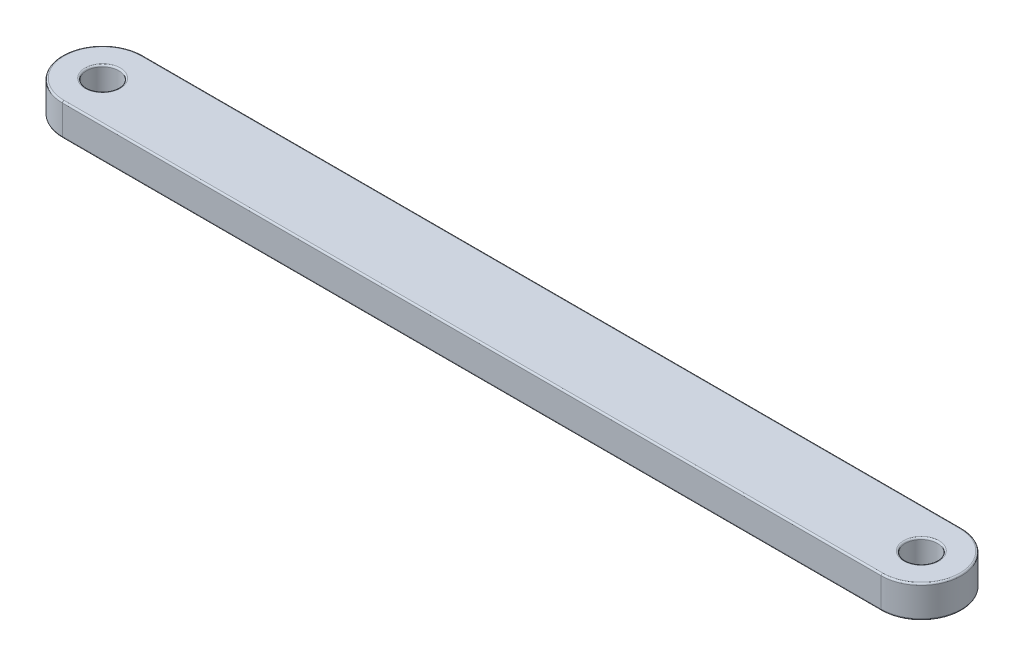
ISO-10303-21;
HEADER;
FILE_DESCRIPTION(('STEP AP214'),'2;1');
FILE_NAME('part.step','',(''),(''),'','','');
FILE_SCHEMA(('AUTOMOTIVE_DESIGN { 1 0 10303 214 1 1 1 1 }'));
ENDSEC;
DATA;
#1=APPLICATION_CONTEXT('core data for automotive mechanical design processes');
#2=APPLICATION_PROTOCOL_DEFINITION('international standard','automotive_design',2000,#1);
#3=PRODUCT_CONTEXT('',#1,'mechanical');
#4=PRODUCT('Part','Part','',(#3));
#5=PRODUCT_RELATED_PRODUCT_CATEGORY('part','',(#4));
#6=PRODUCT_DEFINITION_FORMATION('','',#4);
#7=PRODUCT_DEFINITION_CONTEXT('part definition',#1,'design');
#8=PRODUCT_DEFINITION('design','',#6,#7);
#9=PRODUCT_DEFINITION_SHAPE('','',#8);
#10=(LENGTH_UNIT() NAMED_UNIT(*) SI_UNIT(.MILLI.,.METRE.));
#11=(NAMED_UNIT(*) PLANE_ANGLE_UNIT() SI_UNIT($,.RADIAN.));
#12=(NAMED_UNIT(*) SI_UNIT($,.STERADIAN.) SOLID_ANGLE_UNIT());
#13=UNCERTAINTY_MEASURE_WITH_UNIT(LENGTH_MEASURE(1.E-05),#10,'distance_accuracy_value','');
#14=(GEOMETRIC_REPRESENTATION_CONTEXT(3) GLOBAL_UNCERTAINTY_ASSIGNED_CONTEXT((#13)) GLOBAL_UNIT_ASSIGNED_CONTEXT((#10,
#11,#12)) REPRESENTATION_CONTEXT('',''));
#15=CARTESIAN_POINT('',(0.,0.,0.));
#16=DIRECTION('',(0.,0.,1.));
#17=DIRECTION('',(1.,0.,0.));
#18=AXIS2_PLACEMENT_3D('',#15,#16,#17);
#19=CARTESIAN_POINT('',(-255.,20.,0.));
#20=DIRECTION('',(0.,1.,0.));
#21=DIRECTION('',(0.,0.,1.));
#22=AXIS2_PLACEMENT_3D('',#19,#20,#21);
#23=PLANE('',#22);
#24=CARTESIAN_POINT('',(255.,20.,0.));
#25=DIRECTION('',(0.,1.,0.));
#26=DIRECTION('',(0.,0.,1.));
#27=AXIS2_PLACEMENT_3D('',#24,#25,#26);
#28=CIRCLE('',#27,11.);
#29=CARTESIAN_POINT('',(255.,20.,11.));
#30=VERTEX_POINT('',#29);
#31=EDGE_CURVE('E11',#30,#30,#28,.F.);
#32=ORIENTED_EDGE('',*,*,#31,.T.);
#33=EDGE_LOOP('',(#32));
#34=FACE_BOUND('',#33,.T.);
#35=CARTESIAN_POINT('',(255.,20.,0.));
#36=DIRECTION('',(0.,1.,0.));
#37=DIRECTION('',(0.,0.,1.));
#38=AXIS2_PLACEMENT_3D('',#35,#36,#37);
#39=CIRCLE('',#38,24.);
#40=CARTESIAN_POINT('',(255.,20.,23.9999999999999));
#41=VERTEX_POINT('',#40);
#42=CARTESIAN_POINT('',(255.,20.,-24.0000000000001));
#43=VERTEX_POINT('',#42);
#44=EDGE_CURVE('E49',#41,#43,#39,.T.);
#45=ORIENTED_EDGE('',*,*,#44,.T.);
#46=DIRECTION('',(-1.,0.,0.));
#47=VECTOR('',#46,1.);
#48=CARTESIAN_POINT('',(-255.,20.,-24.));
#49=LINE('',#48,#47);
#50=CARTESIAN_POINT('',(-255.,20.,-24.));
#51=VERTEX_POINT('',#50);
#52=EDGE_CURVE('E41',#43,#51,#49,.T.);
#53=ORIENTED_EDGE('',*,*,#52,.T.);
#54=CARTESIAN_POINT('',(-255.,20.,0.));
#55=DIRECTION('',(0.,1.,0.));
#56=DIRECTION('',(0.,0.,1.));
#57=AXIS2_PLACEMENT_3D('',#54,#55,#56);
#58=CIRCLE('',#57,24.);
#59=CARTESIAN_POINT('',(-255.,20.,24.));
#60=VERTEX_POINT('',#59);
#61=EDGE_CURVE('E167',#51,#60,#58,.T.);
#62=ORIENTED_EDGE('',*,*,#61,.T.);
#63=DIRECTION('',(1.,0.,0.));
#64=VECTOR('',#63,1.);
#65=CARTESIAN_POINT('',(255.,20.,23.9999999999999));
#66=LINE('',#65,#64);
#67=EDGE_CURVE('E54',#60,#41,#66,.T.);
#68=ORIENTED_EDGE('',*,*,#67,.T.);
#69=EDGE_LOOP('',(#45,#53,#62,#68));
#70=FACE_BOUND('',#69,.T.);
#71=CARTESIAN_POINT('',(-255.,20.,0.));
#72=DIRECTION('',(0.,1.,0.));
#73=DIRECTION('',(0.,0.,1.));
#74=AXIS2_PLACEMENT_3D('',#71,#72,#73);
#75=CIRCLE('',#74,11.);
#76=CARTESIAN_POINT('',(-255.,20.,11.));
#77=VERTEX_POINT('',#76);
#78=EDGE_CURVE('E164',#77,#77,#75,.F.);
#79=ORIENTED_EDGE('',*,*,#78,.T.);
#80=EDGE_LOOP('',(#79));
#81=FACE_BOUND('',#80,.T.);
#82=ADVANCED_FACE('F32',(#34,#70,#81),#23,.T.);
#83=CARTESIAN_POINT('',(-255.,0.,0.));
#84=DIRECTION('',(0.,1.,0.));
#85=DIRECTION('',(0.,0.,1.));
#86=AXIS2_PLACEMENT_3D('',#83,#84,#85);
#87=PLANE('',#86);
#88=CARTESIAN_POINT('',(255.,0.,0.));
#89=DIRECTION('',(0.,1.,0.));
#90=DIRECTION('',(0.,0.,1.));
#91=AXIS2_PLACEMENT_3D('',#88,#89,#90);
#92=CIRCLE('',#91,11.);
#93=CARTESIAN_POINT('',(255.,0.,11.));
#94=VERTEX_POINT('',#93);
#95=EDGE_CURVE('E129',#94,#94,#92,.T.);
#96=ORIENTED_EDGE('',*,*,#95,.T.);
#97=EDGE_LOOP('',(#96));
#98=FACE_BOUND('',#97,.T.);
#99=CARTESIAN_POINT('',(-255.,0.,0.));
#100=DIRECTION('',(0.,1.,0.));
#101=DIRECTION('',(0.,0.,1.));
#102=AXIS2_PLACEMENT_3D('',#99,#100,#101);
#103=CIRCLE('',#102,11.);
#104=CARTESIAN_POINT('',(-255.,0.,11.));
#105=VERTEX_POINT('',#104);
#106=EDGE_CURVE('E126',#105,#105,#103,.T.);
#107=ORIENTED_EDGE('',*,*,#106,.T.);
#108=EDGE_LOOP('',(#107));
#109=FACE_BOUND('',#108,.T.);
#110=CARTESIAN_POINT('',(255.,0.,0.));
#111=DIRECTION('',(0.,1.,0.));
#112=DIRECTION('',(0.,0.,1.));
#113=AXIS2_PLACEMENT_3D('',#110,#111,#112);
#114=CIRCLE('',#113,24.);
#115=CARTESIAN_POINT('',(255.,0.,-24.0000000000001));
#116=VERTEX_POINT('',#115);
#117=CARTESIAN_POINT('',(255.,0.,23.9999999999999));
#118=VERTEX_POINT('',#117);
#119=EDGE_CURVE('E125',#116,#118,#114,.F.);
#120=ORIENTED_EDGE('',*,*,#119,.T.);
#121=DIRECTION('',(1.,0.,0.));
#122=VECTOR('',#121,1.);
#123=CARTESIAN_POINT('',(-255.,0.,24.));
#124=LINE('',#123,#122);
#125=CARTESIAN_POINT('',(-255.,0.,24.));
#126=VERTEX_POINT('',#125);
#127=EDGE_CURVE('E104',#118,#126,#124,.F.);
#128=ORIENTED_EDGE('',*,*,#127,.T.);
#129=CARTESIAN_POINT('',(-255.,0.,0.));
#130=DIRECTION('',(0.,1.,0.));
#131=DIRECTION('',(0.,0.,1.));
#132=AXIS2_PLACEMENT_3D('',#129,#130,#131);
#133=CIRCLE('',#132,24.);
#134=CARTESIAN_POINT('',(-255.,0.,-24.));
#135=VERTEX_POINT('',#134);
#136=EDGE_CURVE('E114',#126,#135,#133,.F.);
#137=ORIENTED_EDGE('',*,*,#136,.T.);
#138=DIRECTION('',(-1.,0.,0.));
#139=VECTOR('',#138,1.);
#140=CARTESIAN_POINT('',(-255.,0.,-24.));
#141=LINE('',#140,#139);
#142=EDGE_CURVE('E120',#135,#116,#141,.F.);
#143=ORIENTED_EDGE('',*,*,#142,.T.);
#144=EDGE_LOOP('',(#120,#128,#137,#143));
#145=FACE_BOUND('',#144,.T.);
#146=ADVANCED_FACE('F123',(#98,#109,#145),#87,.F.);
#147=CARTESIAN_POINT('',(-255.,20.,0.));
#148=DIRECTION('',(0.,-1.,0.));
#149=DIRECTION('',(0.,0.,-1.));
#150=AXIS2_PLACEMENT_3D('',#147,#148,#149);
#151=CYLINDRICAL_SURFACE('',#150,25.);
#152=DIRECTION('',(0.,-1.,0.));
#153=VECTOR('',#152,1.);
#154=CARTESIAN_POINT('',(-255.,20.,-25.));
#155=LINE('',#154,#153);
#156=CARTESIAN_POINT('',(-255.,19.,-25.));
#157=VERTEX_POINT('',#156);
#158=CARTESIAN_POINT('',(-255.,1.,-25.));
#159=VERTEX_POINT('',#158);
#160=EDGE_CURVE('E176',#157,#159,#155,.T.);
#161=ORIENTED_EDGE('',*,*,#160,.T.);
#162=CARTESIAN_POINT('',(-255.,1.,0.));
#163=DIRECTION('',(0.,1.,0.));
#164=DIRECTION('',(0.,0.,1.));
#165=AXIS2_PLACEMENT_3D('',#162,#163,#164);
#166=CIRCLE('',#165,25.);
#167=CARTESIAN_POINT('',(-255.,1.,25.));
#168=VERTEX_POINT('',#167);
#169=EDGE_CURVE('E162',#159,#168,#166,.T.);
#170=ORIENTED_EDGE('',*,*,#169,.T.);
#171=DIRECTION('',(0.,-1.,0.));
#172=VECTOR('',#171,1.);
#173=CARTESIAN_POINT('',(-255.,20.,25.));
#174=LINE('',#173,#172);
#175=CARTESIAN_POINT('',(-255.,19.,25.));
#176=VERTEX_POINT('',#175);
#177=EDGE_CURVE('E121',#176,#168,#174,.T.);
#178=ORIENTED_EDGE('',*,*,#177,.F.);
#179=CARTESIAN_POINT('',(-255.,19.,0.));
#180=DIRECTION('',(0.,1.,0.));
#181=DIRECTION('',(0.,0.,1.));
#182=AXIS2_PLACEMENT_3D('',#179,#180,#181);
#183=CIRCLE('',#182,25.);
#184=EDGE_CURVE('E160',#176,#157,#183,.F.);
#185=ORIENTED_EDGE('',*,*,#184,.T.);
#186=EDGE_LOOP('',(#161,#170,#178,#185));
#187=FACE_BOUND('',#186,.T.);
#188=ADVANCED_FACE('F202',(#187),#151,.T.);
#189=CARTESIAN_POINT('',(-255.,20.,25.));
#190=DIRECTION('',(0.,0.,-1.));
#191=DIRECTION('',(-1.,0.,0.));
#192=AXIS2_PLACEMENT_3D('',#189,#190,#191);
#193=PLANE('',#192);
#194=ORIENTED_EDGE('',*,*,#177,.T.);
#195=DIRECTION('',(1.,0.,0.));
#196=VECTOR('',#195,1.);
#197=CARTESIAN_POINT('',(-255.,1.,25.));
#198=LINE('',#197,#196);
#199=CARTESIAN_POINT('',(255.,1.,24.9999999999999));
#200=VERTEX_POINT('',#199);
#201=EDGE_CURVE('E107',#168,#200,#198,.T.);
#202=ORIENTED_EDGE('',*,*,#201,.T.);
#203=DIRECTION('',(0.,-1.,0.));
#204=VECTOR('',#203,1.);
#205=CARTESIAN_POINT('',(255.,20.,24.9999999999999));
#206=LINE('',#205,#204);
#207=CARTESIAN_POINT('',(255.,19.,24.9999999999999));
#208=VERTEX_POINT('',#207);
#209=EDGE_CURVE('E199',#208,#200,#206,.T.);
#210=ORIENTED_EDGE('',*,*,#209,.F.);
#211=DIRECTION('',(1.,0.,0.));
#212=VECTOR('',#211,1.);
#213=CARTESIAN_POINT('',(-255.,19.,25.));
#214=LINE('',#213,#212);
#215=EDGE_CURVE('E148',#208,#176,#214,.F.);
#216=ORIENTED_EDGE('',*,*,#215,.T.);
#217=EDGE_LOOP('',(#194,#202,#210,#216));
#218=FACE_BOUND('',#217,.T.);
#219=ADVANCED_FACE('F197',(#218),#193,.F.);
#220=CARTESIAN_POINT('',(255.,20.,0.));
#221=DIRECTION('',(0.,-1.,0.));
#222=DIRECTION('',(0.,0.,-1.));
#223=AXIS2_PLACEMENT_3D('',#220,#221,#222);
#224=CYLINDRICAL_SURFACE('',#223,25.);
#225=ORIENTED_EDGE('',*,*,#209,.T.);
#226=CARTESIAN_POINT('',(255.,1.,0.));
#227=DIRECTION('',(0.,1.,0.));
#228=DIRECTION('',(0.,0.,1.));
#229=AXIS2_PLACEMENT_3D('',#226,#227,#228);
#230=CIRCLE('',#229,25.);
#231=CARTESIAN_POINT('',(255.,1.,-25.0000000000001));
#232=VERTEX_POINT('',#231);
#233=EDGE_CURVE('E153',#200,#232,#230,.T.);
#234=ORIENTED_EDGE('',*,*,#233,.T.);
#235=DIRECTION('',(0.,-1.,0.));
#236=VECTOR('',#235,1.);
#237=CARTESIAN_POINT('',(255.,20.,-25.0000000000001));
#238=LINE('',#237,#236);
#239=CARTESIAN_POINT('',(255.,19.,-25.0000000000001));
#240=VERTEX_POINT('',#239);
#241=EDGE_CURVE('E205',#240,#232,#238,.T.);
#242=ORIENTED_EDGE('',*,*,#241,.F.);
#243=CARTESIAN_POINT('',(255.,19.,0.));
#244=DIRECTION('',(0.,1.,0.));
#245=DIRECTION('',(0.,0.,1.));
#246=AXIS2_PLACEMENT_3D('',#243,#244,#245);
#247=CIRCLE('',#246,25.);
#248=EDGE_CURVE('E151',#240,#208,#247,.F.);
#249=ORIENTED_EDGE('',*,*,#248,.T.);
#250=EDGE_LOOP('',(#225,#234,#242,#249));
#251=FACE_BOUND('',#250,.T.);
#252=ADVANCED_FACE('F218',(#251),#224,.T.);
#253=CARTESIAN_POINT('',(-255.,20.,-25.));
#254=DIRECTION('',(0.,0.,1.));
#255=DIRECTION('',(1.,0.,0.));
#256=AXIS2_PLACEMENT_3D('',#253,#254,#255);
#257=PLANE('',#256);
#258=ORIENTED_EDGE('',*,*,#241,.T.);
#259=DIRECTION('',(-1.,0.,0.));
#260=VECTOR('',#259,1.);
#261=CARTESIAN_POINT('',(-255.,1.,-25.));
#262=LINE('',#261,#260);
#263=EDGE_CURVE('E158',#232,#159,#262,.T.);
#264=ORIENTED_EDGE('',*,*,#263,.T.);
#265=ORIENTED_EDGE('',*,*,#160,.F.);
#266=DIRECTION('',(-1.,0.,0.));
#267=VECTOR('',#266,1.);
#268=CARTESIAN_POINT('',(255.,19.,-25.0000000000001));
#269=LINE('',#268,#267);
#270=EDGE_CURVE('E155',#157,#240,#269,.F.);
#271=ORIENTED_EDGE('',*,*,#270,.T.);
#272=EDGE_LOOP('',(#258,#264,#265,#271));
#273=FACE_BOUND('',#272,.T.);
#274=ADVANCED_FACE('F222',(#273),#257,.F.);
#275=CARTESIAN_POINT('',(-255.,20.,0.));
#276=DIRECTION('',(0.,-1.,0.));
#277=DIRECTION('',(0.,0.,-1.));
#278=AXIS2_PLACEMENT_3D('',#275,#276,#277);
#279=CYLINDRICAL_SURFACE('',#278,10.);
#280=CARTESIAN_POINT('',(-255.,1.,0.));
#281=DIRECTION('',(0.,1.,0.));
#282=DIRECTION('',(0.,0.,1.));
#283=AXIS2_PLACEMENT_3D('',#280,#281,#282);
#284=CIRCLE('',#283,10.);
#285=CARTESIAN_POINT('',(-255.,1.,10.));
#286=VERTEX_POINT('',#285);
#287=EDGE_CURVE('E145',#286,#286,#284,.F.);
#288=ORIENTED_EDGE('',*,*,#287,.T.);
#289=EDGE_LOOP('',(#288));
#290=FACE_BOUND('',#289,.T.);
#291=CARTESIAN_POINT('',(-255.,19.,0.));
#292=DIRECTION('',(0.,1.,0.));
#293=DIRECTION('',(0.,0.,1.));
#294=AXIS2_PLACEMENT_3D('',#291,#292,#293);
#295=CIRCLE('',#294,10.);
#296=CARTESIAN_POINT('',(-255.,19.,10.));
#297=VERTEX_POINT('',#296);
#298=EDGE_CURVE('E142',#297,#297,#295,.T.);
#299=ORIENTED_EDGE('',*,*,#298,.T.);
#300=EDGE_LOOP('',(#299));
#301=FACE_BOUND('',#300,.T.);
#302=ADVANCED_FACE('F238',(#290,#301),#279,.F.);
#303=CARTESIAN_POINT('',(255.,20.,0.));
#304=DIRECTION('',(0.,-1.,0.));
#305=DIRECTION('',(0.,0.,-1.));
#306=AXIS2_PLACEMENT_3D('',#303,#304,#305);
#307=CYLINDRICAL_SURFACE('',#306,9.99999999999998);
#308=CARTESIAN_POINT('',(255.,1.,0.));
#309=DIRECTION('',(0.,1.,0.));
#310=DIRECTION('',(0.,0.,1.));
#311=AXIS2_PLACEMENT_3D('',#308,#309,#310);
#312=CIRCLE('',#311,9.99999999999998);
#313=CARTESIAN_POINT('',(255.,1.,9.99999999999998));
#314=VERTEX_POINT('',#313);
#315=EDGE_CURVE('E139',#314,#314,#312,.F.);
#316=ORIENTED_EDGE('',*,*,#315,.T.);
#317=EDGE_LOOP('',(#316));
#318=FACE_BOUND('',#317,.T.);
#319=CARTESIAN_POINT('',(255.,19.,0.));
#320=DIRECTION('',(0.,1.,0.));
#321=DIRECTION('',(0.,0.,1.));
#322=AXIS2_PLACEMENT_3D('',#319,#320,#321);
#323=CIRCLE('',#322,9.99999999999998);
#324=CARTESIAN_POINT('',(255.,19.,9.99999999999998));
#325=VERTEX_POINT('',#324);
#326=EDGE_CURVE('E136',#325,#325,#323,.T.);
#327=ORIENTED_EDGE('',*,*,#326,.T.);
#328=EDGE_LOOP('',(#327));
#329=FACE_BOUND('',#328,.T.);
#330=ADVANCED_FACE('F240',(#318,#329),#307,.F.);
#331=CARTESIAN_POINT('',(255.,1.,0.));
#332=DIRECTION('',(0.,1.,0.));
#333=DIRECTION('',(0.,0.,1.));
#334=AXIS2_PLACEMENT_3D('',#331,#332,#333);
#335=TOROIDAL_SURFACE('',#334,11.,1.);
#336=ORIENTED_EDGE('',*,*,#315,.F.);
#337=EDGE_LOOP('',(#336));
#338=FACE_BOUND('',#337,.T.);
#339=ORIENTED_EDGE('',*,*,#95,.F.);
#340=EDGE_LOOP('',(#339));
#341=FACE_BOUND('',#340,.T.);
#342=ADVANCED_FACE('F247',(#338,#341),#335,.T.);
#343=CARTESIAN_POINT('',(-255.,1.,0.));
#344=DIRECTION('',(0.,1.,0.));
#345=DIRECTION('',(0.,0.,1.));
#346=AXIS2_PLACEMENT_3D('',#343,#344,#345);
#347=TOROIDAL_SURFACE('',#346,11.,1.);
#348=ORIENTED_EDGE('',*,*,#287,.F.);
#349=EDGE_LOOP('',(#348));
#350=FACE_BOUND('',#349,.T.);
#351=ORIENTED_EDGE('',*,*,#106,.F.);
#352=EDGE_LOOP('',(#351));
#353=FACE_BOUND('',#352,.T.);
#354=ADVANCED_FACE('F263',(#350,#353),#347,.T.);
#355=CARTESIAN_POINT('',(-255.,1.,-24.));
#356=DIRECTION('',(-1.,0.,0.));
#357=DIRECTION('',(0.,0.,1.));
#358=AXIS2_PLACEMENT_3D('',#355,#356,#357);
#359=CYLINDRICAL_SURFACE('',#358,1.);
#360=CARTESIAN_POINT('',(255.,1.,-24.0000000000001));
#361=DIRECTION('',(1.,0.,0.));
#362=DIRECTION('',(0.,0.,-1.));
#363=AXIS2_PLACEMENT_3D('',#360,#361,#362);
#364=CIRCLE('',#363,1.);
#365=EDGE_CURVE('E110',#116,#232,#364,.T.);
#366=ORIENTED_EDGE('',*,*,#365,.F.);
#367=ORIENTED_EDGE('',*,*,#142,.F.);
#368=CARTESIAN_POINT('',(-255.,1.,-24.));
#369=DIRECTION('',(-1.,0.,0.));
#370=DIRECTION('',(0.,0.,1.));
#371=AXIS2_PLACEMENT_3D('',#368,#369,#370);
#372=CIRCLE('',#371,1.);
#373=EDGE_CURVE('E117',#159,#135,#372,.T.);
#374=ORIENTED_EDGE('',*,*,#373,.F.);
#375=ORIENTED_EDGE('',*,*,#263,.F.);
#376=EDGE_LOOP('',(#366,#367,#374,#375));
#377=FACE_BOUND('',#376,.T.);
#378=ADVANCED_FACE('F211',(#377),#359,.T.);
#379=CARTESIAN_POINT('',(-255.,1.,0.));
#380=DIRECTION('',(0.,1.,0.));
#381=DIRECTION('',(0.,0.,1.));
#382=AXIS2_PLACEMENT_3D('',#379,#380,#381);
#383=TOROIDAL_SURFACE('',#382,24.,1.);
#384=ORIENTED_EDGE('',*,*,#373,.T.);
#385=ORIENTED_EDGE('',*,*,#136,.F.);
#386=CARTESIAN_POINT('',(-255.,1.,24.));
#387=DIRECTION('',(1.,0.,0.));
#388=DIRECTION('',(0.,0.,-1.));
#389=AXIS2_PLACEMENT_3D('',#386,#387,#388);
#390=CIRCLE('',#389,1.);
#391=EDGE_CURVE('E100',#168,#126,#390,.T.);
#392=ORIENTED_EDGE('',*,*,#391,.F.);
#393=ORIENTED_EDGE('',*,*,#169,.F.);
#394=EDGE_LOOP('',(#384,#385,#392,#393));
#395=FACE_BOUND('',#394,.T.);
#396=ADVANCED_FACE('F115',(#395),#383,.T.);
#397=CARTESIAN_POINT('',(255.,1.,0.));
#398=DIRECTION('',(0.,1.,0.));
#399=DIRECTION('',(0.,0.,1.));
#400=AXIS2_PLACEMENT_3D('',#397,#398,#399);
#401=TOROIDAL_SURFACE('',#400,24.,1.);
#402=ORIENTED_EDGE('',*,*,#365,.T.);
#403=ORIENTED_EDGE('',*,*,#233,.F.);
#404=CARTESIAN_POINT('',(255.,1.,23.9999999999999));
#405=DIRECTION('',(-1.,0.,0.));
#406=DIRECTION('',(0.,0.,1.));
#407=AXIS2_PLACEMENT_3D('',#404,#405,#406);
#408=CIRCLE('',#407,1.);
#409=EDGE_CURVE('E111',#118,#200,#408,.T.);
#410=ORIENTED_EDGE('',*,*,#409,.F.);
#411=ORIENTED_EDGE('',*,*,#119,.F.);
#412=EDGE_LOOP('',(#402,#403,#410,#411));
#413=FACE_BOUND('',#412,.T.);
#414=ADVANCED_FACE('F214',(#413),#401,.T.);
#415=CARTESIAN_POINT('',(-255.,1.,24.));
#416=DIRECTION('',(1.,0.,0.));
#417=DIRECTION('',(0.,0.,-1.));
#418=AXIS2_PLACEMENT_3D('',#415,#416,#417);
#419=CYLINDRICAL_SURFACE('',#418,1.);
#420=ORIENTED_EDGE('',*,*,#391,.T.);
#421=ORIENTED_EDGE('',*,*,#127,.F.);
#422=ORIENTED_EDGE('',*,*,#409,.T.);
#423=ORIENTED_EDGE('',*,*,#201,.F.);
#424=EDGE_LOOP('',(#420,#421,#422,#423));
#425=FACE_BOUND('',#424,.T.);
#426=ADVANCED_FACE('F102',(#425),#419,.T.);
#427=CARTESIAN_POINT('',(255.,19.,0.));
#428=DIRECTION('',(0.,1.,0.));
#429=DIRECTION('',(0.,0.,1.));
#430=AXIS2_PLACEMENT_3D('',#427,#428,#429);
#431=TOROIDAL_SURFACE('',#430,11.,1.);
#432=ORIENTED_EDGE('',*,*,#31,.F.);
#433=EDGE_LOOP('',(#432));
#434=FACE_BOUND('',#433,.T.);
#435=ORIENTED_EDGE('',*,*,#326,.F.);
#436=EDGE_LOOP('',(#435));
#437=FACE_BOUND('',#436,.T.);
#438=ADVANCED_FACE('F270',(#434,#437),#431,.T.);
#439=CARTESIAN_POINT('',(-255.,19.,24.));
#440=DIRECTION('',(-1.,0.,0.));
#441=DIRECTION('',(0.,0.,1.));
#442=AXIS2_PLACEMENT_3D('',#439,#440,#441);
#443=CYLINDRICAL_SURFACE('',#442,1.);
#444=CARTESIAN_POINT('',(-255.,19.,24.));
#445=DIRECTION('',(-1.,0.,0.));
#446=DIRECTION('',(0.,0.,1.));
#447=AXIS2_PLACEMENT_3D('',#444,#445,#446);
#448=CIRCLE('',#447,1.);
#449=EDGE_CURVE('E180',#176,#60,#448,.T.);
#450=ORIENTED_EDGE('',*,*,#449,.F.);
#451=ORIENTED_EDGE('',*,*,#215,.F.);
#452=CARTESIAN_POINT('',(255.,19.,23.9999999999999));
#453=DIRECTION('',(1.,0.,0.));
#454=DIRECTION('',(0.,0.,-1.));
#455=AXIS2_PLACEMENT_3D('',#452,#453,#454);
#456=CIRCLE('',#455,1.);
#457=EDGE_CURVE('E36',#41,#208,#456,.T.);
#458=ORIENTED_EDGE('',*,*,#457,.F.);
#459=ORIENTED_EDGE('',*,*,#67,.F.);
#460=EDGE_LOOP('',(#450,#451,#458,#459));
#461=FACE_BOUND('',#460,.T.);
#462=ADVANCED_FACE('F192',(#461),#443,.T.);
#463=CARTESIAN_POINT('',(255.,19.,0.));
#464=DIRECTION('',(0.,1.,0.));
#465=DIRECTION('',(0.,0.,1.));
#466=AXIS2_PLACEMENT_3D('',#463,#464,#465);
#467=TOROIDAL_SURFACE('',#466,24.,1.);
#468=ORIENTED_EDGE('',*,*,#457,.T.);
#469=ORIENTED_EDGE('',*,*,#248,.F.);
#470=CARTESIAN_POINT('',(255.,19.,-24.0000000000001));
#471=DIRECTION('',(-1.,0.,0.));
#472=DIRECTION('',(0.,0.,1.));
#473=AXIS2_PLACEMENT_3D('',#470,#471,#472);
#474=CIRCLE('',#473,1.);
#475=EDGE_CURVE('E179',#43,#240,#474,.T.);
#476=ORIENTED_EDGE('',*,*,#475,.F.);
#477=ORIENTED_EDGE('',*,*,#44,.F.);
#478=EDGE_LOOP('',(#468,#469,#476,#477));
#479=FACE_BOUND('',#478,.T.);
#480=ADVANCED_FACE('F189',(#479),#467,.T.);
#481=CARTESIAN_POINT('',(-255.,19.,0.));
#482=DIRECTION('',(0.,1.,0.));
#483=DIRECTION('',(0.,0.,1.));
#484=AXIS2_PLACEMENT_3D('',#481,#482,#483);
#485=TOROIDAL_SURFACE('',#484,24.,1.);
#486=ORIENTED_EDGE('',*,*,#449,.T.);
#487=ORIENTED_EDGE('',*,*,#61,.F.);
#488=CARTESIAN_POINT('',(-255.,19.,-24.));
#489=DIRECTION('',(1.,0.,0.));
#490=DIRECTION('',(0.,0.,-1.));
#491=AXIS2_PLACEMENT_3D('',#488,#489,#490);
#492=CIRCLE('',#491,1.);
#493=EDGE_CURVE('E177',#157,#51,#492,.T.);
#494=ORIENTED_EDGE('',*,*,#493,.F.);
#495=ORIENTED_EDGE('',*,*,#184,.F.);
#496=EDGE_LOOP('',(#486,#487,#494,#495));
#497=FACE_BOUND('',#496,.T.);
#498=ADVANCED_FACE('F227',(#497),#485,.T.);
#499=CARTESIAN_POINT('',(-255.,19.,-24.));
#500=DIRECTION('',(1.,0.,0.));
#501=DIRECTION('',(0.,0.,-1.));
#502=AXIS2_PLACEMENT_3D('',#499,#500,#501);
#503=CYLINDRICAL_SURFACE('',#502,1.);
#504=ORIENTED_EDGE('',*,*,#475,.T.);
#505=ORIENTED_EDGE('',*,*,#270,.F.);
#506=ORIENTED_EDGE('',*,*,#493,.T.);
#507=ORIENTED_EDGE('',*,*,#52,.F.);
#508=EDGE_LOOP('',(#504,#505,#506,#507));
#509=FACE_BOUND('',#508,.T.);
#510=ADVANCED_FACE('F225',(#509),#503,.T.);
#511=CARTESIAN_POINT('',(-255.,19.,0.));
#512=DIRECTION('',(0.,1.,0.));
#513=DIRECTION('',(0.,0.,1.));
#514=AXIS2_PLACEMENT_3D('',#511,#512,#513);
#515=TOROIDAL_SURFACE('',#514,11.,1.);
#516=ORIENTED_EDGE('',*,*,#78,.F.);
#517=EDGE_LOOP('',(#516));
#518=FACE_BOUND('',#517,.T.);
#519=ORIENTED_EDGE('',*,*,#298,.F.);
#520=EDGE_LOOP('',(#519));
#521=FACE_BOUND('',#520,.T.);
#522=ADVANCED_FACE('F34',(#518,#521),#515,.T.);
#523=CLOSED_SHELL('',(#82,#146,#188,#219,#252,#274,#302,#330,#342,#354,#378,#396,#414,#426,#438,
#462,#480,#498,#510,#522));
#524=MANIFOLD_SOLID_BREP('B2',#523);
#525=ADVANCED_BREP_SHAPE_REPRESENTATION('',(#18,#524),#14);
#526=SHAPE_DEFINITION_REPRESENTATION(#9,#525);
ENDSEC;
END-ISO-10303-21;
